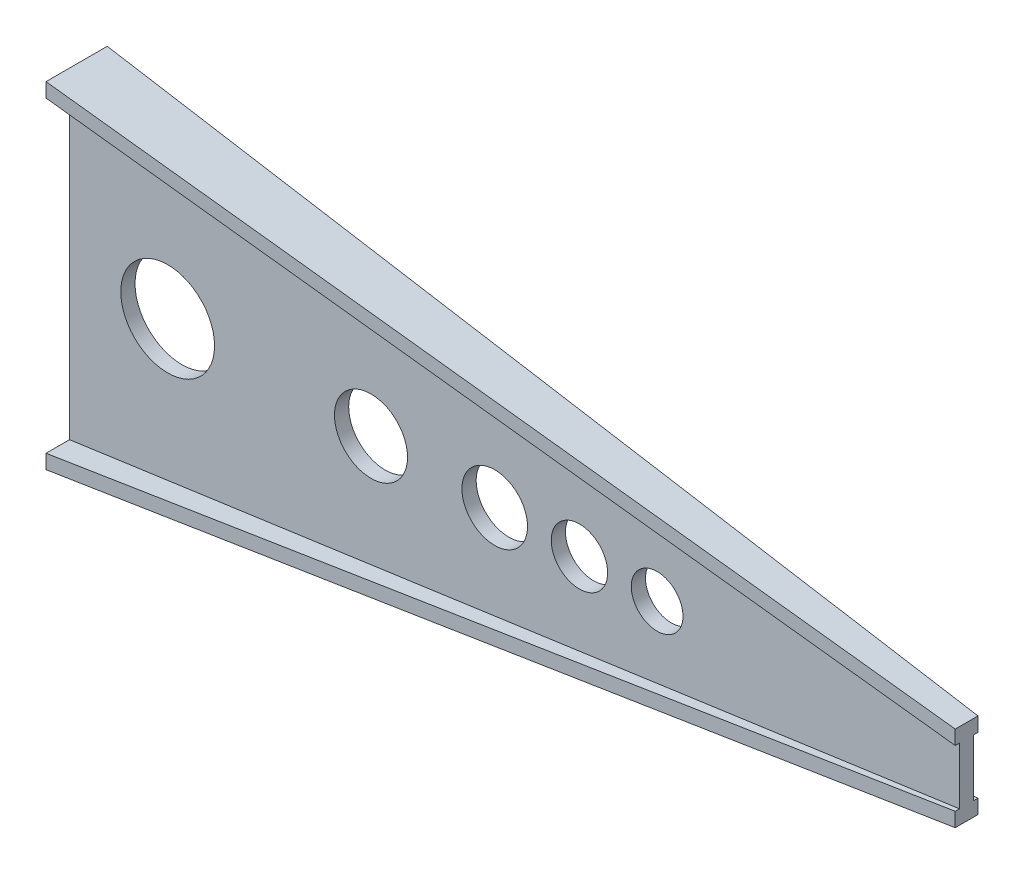
ISO-10303-21;
HEADER;
FILE_DESCRIPTION(('STEP AP214'),'2;1');
FILE_NAME('part.step','',(''),(''),'','','');
FILE_SCHEMA(('AUTOMOTIVE_DESIGN { 1 0 10303 214 1 1 1 1 }'));
ENDSEC;
DATA;
#1=APPLICATION_CONTEXT('core data for automotive mechanical design processes');
#2=APPLICATION_PROTOCOL_DEFINITION('international standard','automotive_design',2000,#1);
#3=PRODUCT_CONTEXT('',#1,'mechanical');
#4=PRODUCT('Part','Part','',(#3));
#5=PRODUCT_RELATED_PRODUCT_CATEGORY('part','',(#4));
#6=PRODUCT_DEFINITION_FORMATION('','',#4);
#7=PRODUCT_DEFINITION_CONTEXT('part definition',#1,'design');
#8=PRODUCT_DEFINITION('design','',#6,#7);
#9=PRODUCT_DEFINITION_SHAPE('','',#8);
#10=(LENGTH_UNIT() NAMED_UNIT(*) SI_UNIT(.MILLI.,.METRE.));
#11=(NAMED_UNIT(*) PLANE_ANGLE_UNIT() SI_UNIT($,.RADIAN.));
#12=(NAMED_UNIT(*) SI_UNIT($,.STERADIAN.) SOLID_ANGLE_UNIT());
#13=UNCERTAINTY_MEASURE_WITH_UNIT(LENGTH_MEASURE(1.E-05),#10,'distance_accuracy_value','');
#14=(GEOMETRIC_REPRESENTATION_CONTEXT(3) GLOBAL_UNCERTAINTY_ASSIGNED_CONTEXT((#13)) GLOBAL_UNIT_ASSIGNED_CONTEXT((#10,
#11,#12)) REPRESENTATION_CONTEXT('',''));
#15=CARTESIAN_POINT('',(0.,0.,0.));
#16=DIRECTION('',(0.,0.,1.));
#17=DIRECTION('',(1.,0.,0.));
#18=AXIS2_PLACEMENT_3D('',#15,#16,#17);
#19=CARTESIAN_POINT('',(1250.,0.,0.));
#20=DIRECTION('',(-1.,0.,0.));
#21=DIRECTION('',(0.,0.,1.));
#22=AXIS2_PLACEMENT_3D('',#19,#20,#21);
#23=PLANE('',#22);
#24=DIRECTION('',(0.,-1.,0.));
#25=VECTOR('',#24,1.);
#26=CARTESIAN_POINT('',(1250.,60.,-5.99999999999967));
#27=LINE('',#26,#25);
#28=CARTESIAN_POINT('',(1250.,60.,-5.99999999999967));
#29=VERTEX_POINT('',#28);
#30=CARTESIAN_POINT('',(1250.,40.,-5.99999999999967));
#31=VERTEX_POINT('',#30);
#32=EDGE_CURVE('E382',#29,#31,#27,.T.);
#33=ORIENTED_EDGE('',*,*,#32,.F.);
#34=DIRECTION('',(0.,0.,-1.));
#35=VECTOR('',#34,1.);
#36=CARTESIAN_POINT('',(1250.,60.,-5.99999999999967));
#37=LINE('',#36,#35);
#38=CARTESIAN_POINT('',(1250.,60.,26.0000000000002));
#39=VERTEX_POINT('',#38);
#40=EDGE_CURVE('E12',#39,#29,#37,.T.);
#41=ORIENTED_EDGE('',*,*,#40,.F.);
#42=DIRECTION('',(0.,1.,0.));
#43=VECTOR('',#42,1.);
#44=CARTESIAN_POINT('',(1250.,60.,26.0000000000002));
#45=LINE('',#44,#43);
#46=CARTESIAN_POINT('',(1250.,40.,26.0000000000002));
#47=VERTEX_POINT('',#46);
#48=EDGE_CURVE('E72',#47,#39,#45,.T.);
#49=ORIENTED_EDGE('',*,*,#48,.F.);
#50=DIRECTION('',(0.,0.,1.));
#51=VECTOR('',#50,1.);
#52=CARTESIAN_POINT('',(1250.,40.,20.0000000000002));
#53=LINE('',#52,#51);
#54=CARTESIAN_POINT('',(1250.,40.,20.0000000000002));
#55=VERTEX_POINT('',#54);
#56=EDGE_CURVE('E660',#55,#47,#53,.T.);
#57=ORIENTED_EDGE('',*,*,#56,.F.);
#58=DIRECTION('',(0.,1.,0.));
#59=VECTOR('',#58,1.);
#60=CARTESIAN_POINT('',(1250.,40.,20.0000000000002));
#61=LINE('',#60,#59);
#62=CARTESIAN_POINT('',(1250.,-40.,20.0000000000002));
#63=VERTEX_POINT('',#62);
#64=EDGE_CURVE('E419',#63,#55,#61,.T.);
#65=ORIENTED_EDGE('',*,*,#64,.F.);
#66=DIRECTION('',(0.,0.,-1.));
#67=VECTOR('',#66,1.);
#68=CARTESIAN_POINT('',(1250.,-40.,20.0000000000002));
#69=LINE('',#68,#67);
#70=CARTESIAN_POINT('',(1250.,-40.,26.0000000000002));
#71=VERTEX_POINT('',#70);
#72=EDGE_CURVE('E433',#71,#63,#69,.T.);
#73=ORIENTED_EDGE('',*,*,#72,.F.);
#74=DIRECTION('',(0.,1.,0.));
#75=VECTOR('',#74,1.);
#76=CARTESIAN_POINT('',(1250.,-40.,26.0000000000002));
#77=LINE('',#76,#75);
#78=CARTESIAN_POINT('',(1250.,-60.,26.0000000000002));
#79=VERTEX_POINT('',#78);
#80=EDGE_CURVE('E447',#79,#71,#77,.T.);
#81=ORIENTED_EDGE('',*,*,#80,.F.);
#82=DIRECTION('',(0.,0.,1.));
#83=VECTOR('',#82,1.);
#84=CARTESIAN_POINT('',(1250.,-60.,-5.99999999999967));
#85=LINE('',#84,#83);
#86=CARTESIAN_POINT('',(1250.,-60.,-5.99999999999967));
#87=VERTEX_POINT('',#86);
#88=EDGE_CURVE('E631',#87,#79,#85,.T.);
#89=ORIENTED_EDGE('',*,*,#88,.F.);
#90=DIRECTION('',(0.,-1.,0.));
#91=VECTOR('',#90,1.);
#92=CARTESIAN_POINT('',(1250.,-40.,-5.99999999999967));
#93=LINE('',#92,#91);
#94=CARTESIAN_POINT('',(1250.,-40.,-5.99999999999967));
#95=VERTEX_POINT('',#94);
#96=EDGE_CURVE('E623',#95,#87,#93,.T.);
#97=ORIENTED_EDGE('',*,*,#96,.F.);
#98=DIRECTION('',(0.,0.,-1.));
#99=VECTOR('',#98,1.);
#100=CARTESIAN_POINT('',(1250.,-40.,-5.99999999999967));
#101=LINE('',#100,#99);
#102=CARTESIAN_POINT('',(1250.,-40.,2.22044604925031E-13));
#103=VERTEX_POINT('',#102);
#104=EDGE_CURVE('E535',#103,#95,#101,.T.);
#105=ORIENTED_EDGE('',*,*,#104,.F.);
#106=DIRECTION('',(0.,-1.,0.));
#107=VECTOR('',#106,1.);
#108=CARTESIAN_POINT('',(1250.,40.,2.22044604925031E-13));
#109=LINE('',#108,#107);
#110=CARTESIAN_POINT('',(1250.,40.,2.22044604925031E-13));
#111=VERTEX_POINT('',#110);
#112=EDGE_CURVE('E86',#111,#103,#109,.T.);
#113=ORIENTED_EDGE('',*,*,#112,.F.);
#114=DIRECTION('',(0.,0.,1.));
#115=VECTOR('',#114,1.);
#116=CARTESIAN_POINT('',(1250.,40.,-5.99999999999967));
#117=LINE('',#116,#115);
#118=EDGE_CURVE('E80',#31,#111,#117,.T.);
#119=ORIENTED_EDGE('',*,*,#118,.F.);
#120=EDGE_LOOP('',(#33,#41,#49,#57,#65,#73,#81,#89,#97,#105,#113,#119));
#121=FACE_BOUND('',#120,.T.);
#122=ADVANCED_FACE('F63',(#121),#23,.F.);
#123=CARTESIAN_POINT('',(0.,0.,0.));
#124=DIRECTION('',(1.,0.,0.));
#125=DIRECTION('',(0.,0.,-1.));
#126=AXIS2_PLACEMENT_3D('',#123,#124,#125);
#127=PLANE('',#126);
#128=DIRECTION('',(0.,-1.,0.));
#129=VECTOR('',#128,1.);
#130=CARTESIAN_POINT('',(0.,236.,53.0000000000002));
#131=LINE('',#130,#129);
#132=CARTESIAN_POINT('',(0.,236.,53.0000000000002));
#133=VERTEX_POINT('',#132);
#134=CARTESIAN_POINT('',(0.,216.,53.0000000000002));
#135=VERTEX_POINT('',#134);
#136=EDGE_CURVE('E161',#133,#135,#131,.T.);
#137=ORIENTED_EDGE('',*,*,#136,.F.);
#138=DIRECTION('',(0.,0.,1.));
#139=VECTOR('',#138,1.);
#140=CARTESIAN_POINT('',(0.,236.,53.0000000000002));
#141=LINE('',#140,#139);
#142=CARTESIAN_POINT('',(0.,236.,-32.9999999999998));
#143=VERTEX_POINT('',#142);
#144=EDGE_CURVE('E170',#143,#133,#141,.T.);
#145=ORIENTED_EDGE('',*,*,#144,.F.);
#146=DIRECTION('',(0.,1.,0.));
#147=VECTOR('',#146,1.);
#148=CARTESIAN_POINT('',(0.,236.,-32.9999999999998));
#149=LINE('',#148,#147);
#150=CARTESIAN_POINT('',(0.,216.,-32.9999999999998));
#151=VERTEX_POINT('',#150);
#152=EDGE_CURVE('E177',#151,#143,#149,.T.);
#153=ORIENTED_EDGE('',*,*,#152,.F.);
#154=DIRECTION('',(0.,0.,-1.));
#155=VECTOR('',#154,1.);
#156=CARTESIAN_POINT('',(0.,216.,2.03398214690338E-13));
#157=LINE('',#156,#155);
#158=CARTESIAN_POINT('',(0.,216.,2.03398214690338E-13));
#159=VERTEX_POINT('',#158);
#160=EDGE_CURVE('E305',#159,#151,#157,.T.);
#161=ORIENTED_EDGE('',*,*,#160,.F.);
#162=DIRECTION('',(0.,1.,0.));
#163=VECTOR('',#162,1.);
#164=CARTESIAN_POINT('',(0.,216.,2.03398214690338E-13));
#165=LINE('',#164,#163);
#166=CARTESIAN_POINT('',(0.,-216.,2.03398214690338E-13));
#167=VERTEX_POINT('',#166);
#168=EDGE_CURVE('E301',#167,#159,#165,.T.);
#169=ORIENTED_EDGE('',*,*,#168,.F.);
#170=DIRECTION('',(0.,0.,1.));
#171=VECTOR('',#170,1.);
#172=CARTESIAN_POINT('',(0.,-216.,2.03398214690338E-13));
#173=LINE('',#172,#171);
#174=CARTESIAN_POINT('',(0.,-216.,-32.9999999999999));
#175=VERTEX_POINT('',#174);
#176=EDGE_CURVE('E297',#175,#167,#173,.T.);
#177=ORIENTED_EDGE('',*,*,#176,.F.);
#178=DIRECTION('',(0.,1.,0.));
#179=VECTOR('',#178,1.);
#180=CARTESIAN_POINT('',(0.,-216.,-32.9999999999999));
#181=LINE('',#180,#179);
#182=CARTESIAN_POINT('',(0.,-236.,-32.9999999999999));
#183=VERTEX_POINT('',#182);
#184=EDGE_CURVE('E293',#183,#175,#181,.T.);
#185=ORIENTED_EDGE('',*,*,#184,.F.);
#186=DIRECTION('',(0.,0.,-1.));
#187=VECTOR('',#186,1.);
#188=CARTESIAN_POINT('',(0.,-236.,53.0000000000001));
#189=LINE('',#188,#187);
#190=CARTESIAN_POINT('',(0.,-236.,53.0000000000001));
#191=VERTEX_POINT('',#190);
#192=EDGE_CURVE('E289',#191,#183,#189,.T.);
#193=ORIENTED_EDGE('',*,*,#192,.F.);
#194=DIRECTION('',(0.,-1.,0.));
#195=VECTOR('',#194,1.);
#196=CARTESIAN_POINT('',(0.,-216.,53.0000000000001));
#197=LINE('',#196,#195);
#198=CARTESIAN_POINT('',(0.,-216.,53.0000000000001));
#199=VERTEX_POINT('',#198);
#200=EDGE_CURVE('E285',#199,#191,#197,.T.);
#201=ORIENTED_EDGE('',*,*,#200,.F.);
#202=DIRECTION('',(0.,0.,1.));
#203=VECTOR('',#202,1.);
#204=CARTESIAN_POINT('',(0.,-216.,53.0000000000001));
#205=LINE('',#204,#203);
#206=CARTESIAN_POINT('',(0.,-216.,20.0000000000002));
#207=VERTEX_POINT('',#206);
#208=EDGE_CURVE('E280',#207,#199,#205,.T.);
#209=ORIENTED_EDGE('',*,*,#208,.F.);
#210=DIRECTION('',(0.,-1.,0.));
#211=VECTOR('',#210,1.);
#212=CARTESIAN_POINT('',(0.,216.,20.0000000000002));
#213=LINE('',#212,#211);
#214=CARTESIAN_POINT('',(0.,216.,20.0000000000002));
#215=VERTEX_POINT('',#214);
#216=EDGE_CURVE('E278',#215,#207,#213,.T.);
#217=ORIENTED_EDGE('',*,*,#216,.F.);
#218=DIRECTION('',(0.,0.,-1.));
#219=VECTOR('',#218,1.);
#220=CARTESIAN_POINT('',(0.,216.,53.0000000000002));
#221=LINE('',#220,#219);
#222=EDGE_CURVE('E184',#135,#215,#221,.T.);
#223=ORIENTED_EDGE('',*,*,#222,.F.);
#224=EDGE_LOOP('',(#137,#145,#153,#161,#169,#177,#185,#193,#201,#209,#217,#223));
#225=FACE_BOUND('',#224,.T.);
#226=ADVANCED_FACE('F182',(#225),#127,.F.);
#227=CARTESIAN_POINT('',(0.,0.,20.0000000000002));
#228=DIRECTION('',(0.,0.,1.));
#229=DIRECTION('',(1.,0.,0.));
#230=AXIS2_PLACEMENT_3D('',#227,#228,#229);
#231=PLANE('',#230);
#232=CARTESIAN_POINT('',(137.875176339264,0.,20.0000000000002));
#233=DIRECTION('',(0.,0.,1.));
#234=DIRECTION('',(1.,0.,0.));
#235=AXIS2_PLACEMENT_3D('',#232,#233,#234);
#236=CIRCLE('',#235,65.8387759066305);
#237=CARTESIAN_POINT('',(203.713952245895,0.,20.0000000000002));
#238=VERTEX_POINT('',#237);
#239=EDGE_CURVE('E774',#238,#238,#236,.T.);
#240=ORIENTED_EDGE('',*,*,#239,.F.);
#241=EDGE_LOOP('',(#240));
#242=FACE_BOUND('',#241,.T.);
#243=CARTESIAN_POINT('',(423.461863641876,0.,20.0000000000002));
#244=DIRECTION('',(0.,0.,1.));
#245=DIRECTION('',(1.,0.,0.));
#246=AXIS2_PLACEMENT_3D('',#243,#244,#245);
#247=CIRCLE('',#246,51.3401379448235);
#248=CARTESIAN_POINT('',(474.802001586699,0.,20.0000000000002));
#249=VERTEX_POINT('',#248);
#250=EDGE_CURVE('E777',#249,#249,#247,.T.);
#251=ORIENTED_EDGE('',*,*,#250,.F.);
#252=EDGE_LOOP('',(#251));
#253=FACE_BOUND('',#252,.T.);
#254=CARTESIAN_POINT('',(597.226106194989,0.,20.0000000000002));
#255=DIRECTION('',(0.,0.,1.));
#256=DIRECTION('',(1.,0.,0.));
#257=AXIS2_PLACEMENT_3D('',#254,#255,#256);
#258=CIRCLE('',#257,46.0827762782799);
#259=CARTESIAN_POINT('',(643.308882473269,0.,20.0000000000002));
#260=VERTEX_POINT('',#259);
#261=EDGE_CURVE('E783',#260,#260,#258,.T.);
#262=ORIENTED_EDGE('',*,*,#261,.F.);
#263=EDGE_LOOP('',(#262));
#264=FACE_BOUND('',#263,.T.);
#265=CARTESIAN_POINT('',(825.31333969711,0.,20.0000000000002));
#266=DIRECTION('',(0.,0.,1.));
#267=DIRECTION('',(1.,0.,0.));
#268=AXIS2_PLACEMENT_3D('',#265,#266,#267);
#269=CIRCLE('',#268,36.3132216652579);
#270=CARTESIAN_POINT('',(861.626561362368,0.,20.0000000000002));
#271=VERTEX_POINT('',#270);
#272=EDGE_CURVE('E788',#271,#271,#269,.T.);
#273=ORIENTED_EDGE('',*,*,#272,.F.);
#274=EDGE_LOOP('',(#273));
#275=FACE_BOUND('',#274,.T.);
#276=CARTESIAN_POINT('',(716.202882205903,0.,20.0000000000002));
#277=DIRECTION('',(0.,0.,1.));
#278=DIRECTION('',(1.,0.,0.));
#279=AXIS2_PLACEMENT_3D('',#276,#277,#278);
#280=CIRCLE('',#279,39.6209056920348);
#281=CARTESIAN_POINT('',(755.823787897938,0.,20.0000000000002));
#282=VERTEX_POINT('',#281);
#283=EDGE_CURVE('E790',#282,#282,#280,.T.);
#284=ORIENTED_EDGE('',*,*,#283,.F.);
#285=EDGE_LOOP('',(#284));
#286=FACE_BOUND('',#285,.T.);
#287=DIRECTION('',(0.990232667812309,0.139424759627973,0.));
#288=VECTOR('',#287,1.);
#289=CARTESIAN_POINT('',(0.,-216.,20.0000000000002));
#290=LINE('',#289,#288);
#291=EDGE_CURVE('E176',#207,#63,#290,.T.);
#292=ORIENTED_EDGE('',*,*,#291,.T.);
#293=ORIENTED_EDGE('',*,*,#64,.T.);
#294=DIRECTION('',(0.990232667812309,-0.139424759627973,0.));
#295=VECTOR('',#294,1.);
#296=CARTESIAN_POINT('',(0.,216.,20.0000000000002));
#297=LINE('',#296,#295);
#298=EDGE_CURVE('E392',#215,#55,#297,.T.);
#299=ORIENTED_EDGE('',*,*,#298,.F.);
#300=ORIENTED_EDGE('',*,*,#216,.T.);
#301=EDGE_LOOP('',(#292,#293,#299,#300));
#302=FACE_BOUND('',#301,.T.);
#303=ADVANCED_FACE('F206',(#242,#253,#264,#275,#286,#302),#231,.T.);
#304=CARTESIAN_POINT('',(29.8215975640675,211.801119062979,0.));
#305=DIRECTION('',(-0.139424759627973,-0.990232667812309,0.));
#306=DIRECTION('',(0.990232667812309,-0.139424759627973,0.));
#307=AXIS2_PLACEMENT_3D('',#304,#305,#306);
#308=PLANE('',#307);
#309=ORIENTED_EDGE('',*,*,#298,.T.);
#310=ORIENTED_EDGE('',*,*,#56,.T.);
#311=DIRECTION('',(0.990006234524492,-0.139392877821049,-0.021384134665729));
#312=VECTOR('',#311,1.);
#313=CARTESIAN_POINT('',(0.,216.,53.0000000000002));
#314=LINE('',#313,#312);
#315=EDGE_CURVE('E166',#135,#47,#314,.T.);
#316=ORIENTED_EDGE('',*,*,#315,.F.);
#317=ORIENTED_EDGE('',*,*,#222,.T.);
#318=EDGE_LOOP('',(#309,#310,#316,#317));
#319=FACE_BOUND('',#318,.T.);
#320=ADVANCED_FACE('F394',(#319),#308,.T.);
#321=CARTESIAN_POINT('',(29.8215975640675,-211.801119062979,0.));
#322=DIRECTION('',(-0.139424759627973,0.990232667812309,0.));
#323=DIRECTION('',(-0.990232667812309,-0.139424759627973,0.));
#324=AXIS2_PLACEMENT_3D('',#321,#322,#323);
#325=PLANE('',#324);
#326=DIRECTION('',(0.990006234524492,0.139392877821049,-0.0213841346657289));
#327=VECTOR('',#326,1.);
#328=CARTESIAN_POINT('',(0.,-216.,53.0000000000001));
#329=LINE('',#328,#327);
#330=EDGE_CURVE('E480',#199,#71,#329,.T.);
#331=ORIENTED_EDGE('',*,*,#330,.T.);
#332=ORIENTED_EDGE('',*,*,#72,.T.);
#333=ORIENTED_EDGE('',*,*,#291,.F.);
#334=ORIENTED_EDGE('',*,*,#208,.T.);
#335=EDGE_LOOP('',(#331,#332,#333,#334));
#336=FACE_BOUND('',#335,.T.);
#337=ADVANCED_FACE('F403',(#336),#325,.T.);
#338=CARTESIAN_POINT('',(1.14426613119382,0.,52.9752838515663));
#339=DIRECTION('',(0.0215949629145083,0.,0.999766801597613));
#340=DIRECTION('',(0.999766801597613,0.,-0.0215949629145083));
#341=AXIS2_PLACEMENT_3D('',#338,#339,#340);
#342=PLANE('',#341);
#343=DIRECTION('',(0.990006234524492,0.139392877821049,-0.0213841346657289));
#344=VECTOR('',#343,1.);
#345=CARTESIAN_POINT('',(0.,-236.,53.0000000000001));
#346=LINE('',#345,#344);
#347=EDGE_CURVE('E472',#191,#79,#346,.T.);
#348=ORIENTED_EDGE('',*,*,#347,.T.);
#349=ORIENTED_EDGE('',*,*,#80,.T.);
#350=ORIENTED_EDGE('',*,*,#330,.F.);
#351=ORIENTED_EDGE('',*,*,#200,.T.);
#352=EDGE_LOOP('',(#348,#349,#350,#351));
#353=FACE_BOUND('',#352,.T.);
#354=ADVANCED_FACE('F453',(#353),#342,.T.);
#355=CARTESIAN_POINT('',(32.5828565977774,-231.412333791033,0.));
#356=DIRECTION('',(0.139424759627973,-0.990232667812309,0.));
#357=DIRECTION('',(0.990232667812309,0.139424759627973,0.));
#358=AXIS2_PLACEMENT_3D('',#355,#356,#357);
#359=PLANE('',#358);
#360=DIRECTION('',(0.990006234524492,0.139392877821049,0.0213841346657292));
#361=VECTOR('',#360,1.);
#362=CARTESIAN_POINT('',(0.,-236.,-32.9999999999999));
#363=LINE('',#362,#361);
#364=EDGE_CURVE('E479',#183,#87,#363,.T.);
#365=ORIENTED_EDGE('',*,*,#364,.T.);
#366=ORIENTED_EDGE('',*,*,#88,.T.);
#367=ORIENTED_EDGE('',*,*,#347,.F.);
#368=ORIENTED_EDGE('',*,*,#192,.T.);
#369=EDGE_LOOP('',(#365,#366,#367,#368));
#370=FACE_BOUND('',#369,.T.);
#371=ADVANCED_FACE('F462',(#370),#359,.T.);
#372=CARTESIAN_POINT('',(0.712467591120692,0.,-32.9846107000317));
#373=DIRECTION('',(0.0215949629145086,0.,-0.999766801597613));
#374=DIRECTION('',(-0.999766801597613,0.,-0.0215949629145087));
#375=AXIS2_PLACEMENT_3D('',#372,#373,#374);
#376=PLANE('',#375);
#377=DIRECTION('',(0.990006234524492,0.139392877821049,0.0213841346657292));
#378=VECTOR('',#377,1.);
#379=CARTESIAN_POINT('',(0.,-216.,-32.9999999999999));
#380=LINE('',#379,#378);
#381=EDGE_CURVE('E497',#175,#95,#380,.T.);
#382=ORIENTED_EDGE('',*,*,#381,.T.);
#383=ORIENTED_EDGE('',*,*,#96,.T.);
#384=ORIENTED_EDGE('',*,*,#364,.F.);
#385=ORIENTED_EDGE('',*,*,#184,.T.);
#386=EDGE_LOOP('',(#382,#383,#384,#385));
#387=FACE_BOUND('',#386,.T.);
#388=ADVANCED_FACE('F508',(#387),#376,.T.);
#389=CARTESIAN_POINT('',(29.8215975640675,-211.801119062979,0.));
#390=DIRECTION('',(-0.139424759627973,0.990232667812309,0.));
#391=DIRECTION('',(-0.990232667812309,-0.139424759627973,0.));
#392=AXIS2_PLACEMENT_3D('',#389,#390,#391);
#393=PLANE('',#392);
#394=DIRECTION('',(0.990232667812309,0.139424759627973,0.));
#395=VECTOR('',#394,1.);
#396=CARTESIAN_POINT('',(0.,-216.,2.03398214690338E-13));
#397=LINE('',#396,#395);
#398=EDGE_CURVE('E575',#167,#103,#397,.T.);
#399=ORIENTED_EDGE('',*,*,#398,.T.);
#400=ORIENTED_EDGE('',*,*,#104,.T.);
#401=ORIENTED_EDGE('',*,*,#381,.F.);
#402=ORIENTED_EDGE('',*,*,#176,.T.);
#403=EDGE_LOOP('',(#399,#400,#401,#402));
#404=FACE_BOUND('',#403,.T.);
#405=ADVANCED_FACE('F517',(#404),#393,.T.);
#406=CARTESIAN_POINT('',(0.,0.,2.03398214690338E-13));
#407=DIRECTION('',(0.,0.,-1.));
#408=DIRECTION('',(-1.,0.,0.));
#409=AXIS2_PLACEMENT_3D('',#406,#407,#408);
#410=PLANE('',#409);
#411=CARTESIAN_POINT('',(137.875176339264,0.,2.0122792321331E-13));
#412=DIRECTION('',(0.,0.,-1.));
#413=DIRECTION('',(-1.,0.,0.));
#414=AXIS2_PLACEMENT_3D('',#411,#412,#413);
#415=CIRCLE('',#414,65.8387759066305);
#416=CARTESIAN_POINT('',(72.0364004326338,0.,2.00245798806806E-13));
#417=VERTEX_POINT('',#416);
#418=EDGE_CURVE('E67',#417,#417,#415,.T.);
#419=ORIENTED_EDGE('',*,*,#418,.F.);
#420=EDGE_LOOP('',(#419));
#421=FACE_BOUND('',#420,.T.);
#422=CARTESIAN_POINT('',(423.461863641876,0.,2.08166817117217E-13));
#423=DIRECTION('',(0.,0.,-1.));
#424=DIRECTION('',(-1.,0.,0.));
#425=AXIS2_PLACEMENT_3D('',#422,#423,#424);
#426=CIRCLE('',#425,51.3401379448235);
#427=CARTESIAN_POINT('',(372.121725697052,0.,2.07400970519759E-13));
#428=VERTEX_POINT('',#427);
#429=EDGE_CURVE('E909',#428,#428,#426,.T.);
#430=ORIENTED_EDGE('',*,*,#429,.F.);
#431=EDGE_LOOP('',(#430));
#432=FACE_BOUND('',#431,.T.);
#433=CARTESIAN_POINT('',(597.226106194989,0.,2.08166817117217E-13));
#434=DIRECTION('',(0.,0.,-1.));
#435=DIRECTION('',(-1.,0.,0.));
#436=AXIS2_PLACEMENT_3D('',#433,#434,#435);
#437=CIRCLE('',#436,46.0827762782799);
#438=CARTESIAN_POINT('',(551.143329916709,0.,2.07479395173551E-13));
#439=VERTEX_POINT('',#438);
#440=EDGE_CURVE('E903',#439,#439,#437,.T.);
#441=ORIENTED_EDGE('',*,*,#440,.F.);
#442=EDGE_LOOP('',(#441));
#443=FACE_BOUND('',#442,.T.);
#444=CARTESIAN_POINT('',(825.31333969711,0.,2.15105711021124E-13));
#445=DIRECTION('',(0.,0.,-1.));
#446=DIRECTION('',(-1.,0.,0.));
#447=AXIS2_PLACEMENT_3D('',#444,#445,#446);
#448=CIRCLE('',#447,36.3132216652579);
#449=CARTESIAN_POINT('',(789.000118031852,0.,2.14564022619645E-13));
#450=VERTEX_POINT('',#449);
#451=EDGE_CURVE('E780',#450,#450,#448,.T.);
#452=ORIENTED_EDGE('',*,*,#451,.F.);
#453=EDGE_LOOP('',(#452));
#454=FACE_BOUND('',#453,.T.);
#455=CARTESIAN_POINT('',(716.202882205903,0.,2.15105711021124E-13));
#456=DIRECTION('',(0.,0.,-1.));
#457=DIRECTION('',(-1.,0.,0.));
#458=AXIS2_PLACEMENT_3D('',#455,#456,#457);
#459=CIRCLE('',#458,39.6209056920348);
#460=CARTESIAN_POINT('',(676.581976513868,0.,2.14514681525936E-13));
#461=VERTEX_POINT('',#460);
#462=EDGE_CURVE('E776',#461,#461,#459,.T.);
#463=ORIENTED_EDGE('',*,*,#462,.F.);
#464=EDGE_LOOP('',(#463));
#465=FACE_BOUND('',#464,.T.);
#466=DIRECTION('',(0.990232667812309,-0.139424759627973,0.));
#467=VECTOR('',#466,1.);
#468=CARTESIAN_POINT('',(0.,216.,2.03398214690338E-13));
#469=LINE('',#468,#467);
#470=EDGE_CURVE('E567',#159,#111,#469,.T.);
#471=ORIENTED_EDGE('',*,*,#470,.T.);
#472=ORIENTED_EDGE('',*,*,#112,.T.);
#473=ORIENTED_EDGE('',*,*,#398,.F.);
#474=ORIENTED_EDGE('',*,*,#168,.T.);
#475=EDGE_LOOP('',(#471,#472,#473,#474));
#476=FACE_BOUND('',#475,.T.);
#477=ADVANCED_FACE('F551',(#421,#432,#443,#454,#465,#476),#410,.T.);
#478=CARTESIAN_POINT('',(29.8215975640675,211.801119062979,0.));
#479=DIRECTION('',(-0.139424759627973,-0.990232667812309,0.));
#480=DIRECTION('',(0.990232667812309,-0.139424759627973,0.));
#481=AXIS2_PLACEMENT_3D('',#478,#479,#480);
#482=PLANE('',#481);
#483=DIRECTION('',(0.990006234524492,-0.139392877821049,0.0213841346657291));
#484=VECTOR('',#483,1.);
#485=CARTESIAN_POINT('',(0.,216.,-32.9999999999998));
#486=LINE('',#485,#484);
#487=EDGE_CURVE('E574',#151,#31,#486,.T.);
#488=ORIENTED_EDGE('',*,*,#487,.T.);
#489=ORIENTED_EDGE('',*,*,#118,.T.);
#490=ORIENTED_EDGE('',*,*,#470,.F.);
#491=ORIENTED_EDGE('',*,*,#160,.T.);
#492=EDGE_LOOP('',(#488,#489,#490,#491));
#493=FACE_BOUND('',#492,.T.);
#494=ADVANCED_FACE('F332',(#493),#482,.T.);
#495=CARTESIAN_POINT('',(0.712467591120685,0.,-32.9846107000316));
#496=DIRECTION('',(0.0215949629145085,0.,-0.999766801597613));
#497=DIRECTION('',(-0.999766801597613,0.,-0.0215949629145085));
#498=AXIS2_PLACEMENT_3D('',#495,#496,#497);
#499=PLANE('',#498);
#500=DIRECTION('',(0.990006234524492,-0.139392877821049,0.0213841346657291));
#501=VECTOR('',#500,1.);
#502=CARTESIAN_POINT('',(0.,236.,-32.9999999999998));
#503=LINE('',#502,#501);
#504=EDGE_CURVE('E167',#143,#29,#503,.T.);
#505=ORIENTED_EDGE('',*,*,#504,.T.);
#506=ORIENTED_EDGE('',*,*,#32,.T.);
#507=ORIENTED_EDGE('',*,*,#487,.F.);
#508=ORIENTED_EDGE('',*,*,#152,.T.);
#509=EDGE_LOOP('',(#505,#506,#507,#508));
#510=FACE_BOUND('',#509,.T.);
#511=ADVANCED_FACE('F322',(#510),#499,.T.);
#512=CARTESIAN_POINT('',(32.5828565977774,231.412333791033,0.));
#513=DIRECTION('',(0.139424759627973,0.990232667812309,0.));
#514=DIRECTION('',(-0.990232667812309,0.139424759627973,0.));
#515=AXIS2_PLACEMENT_3D('',#512,#513,#514);
#516=PLANE('',#515);
#517=DIRECTION('',(0.990006234524492,-0.139392877821049,-0.021384134665729));
#518=VECTOR('',#517,1.);
#519=CARTESIAN_POINT('',(0.,236.,53.0000000000002));
#520=LINE('',#519,#518);
#521=EDGE_CURVE('E156',#133,#39,#520,.T.);
#522=ORIENTED_EDGE('',*,*,#521,.T.);
#523=ORIENTED_EDGE('',*,*,#40,.T.);
#524=ORIENTED_EDGE('',*,*,#504,.F.);
#525=ORIENTED_EDGE('',*,*,#144,.T.);
#526=EDGE_LOOP('',(#522,#523,#524,#525));
#527=FACE_BOUND('',#526,.T.);
#528=ADVANCED_FACE('F172',(#527),#516,.T.);
#529=CARTESIAN_POINT('',(1.14426613119383,0.,52.9752838515664));
#530=DIRECTION('',(0.0215949629145084,0.,0.999766801597613));
#531=DIRECTION('',(0.999766801597613,0.,-0.0215949629145084));
#532=AXIS2_PLACEMENT_3D('',#529,#530,#531);
#533=PLANE('',#532);
#534=ORIENTED_EDGE('',*,*,#315,.T.);
#535=ORIENTED_EDGE('',*,*,#48,.T.);
#536=ORIENTED_EDGE('',*,*,#521,.F.);
#537=ORIENTED_EDGE('',*,*,#136,.T.);
#538=EDGE_LOOP('',(#534,#535,#536,#537));
#539=FACE_BOUND('',#538,.T.);
#540=ADVANCED_FACE('F159',(#539),#533,.T.);
#541=CARTESIAN_POINT('',(716.202882205903,0.,-33.0000999999999));
#542=DIRECTION('',(0.,0.,1.));
#543=DIRECTION('',(1.,0.,0.));
#544=AXIS2_PLACEMENT_3D('',#541,#542,#543);
#545=CYLINDRICAL_SURFACE('',#544,39.6209056920348);
#546=ORIENTED_EDGE('',*,*,#462,.T.);
#547=EDGE_LOOP('',(#546));
#548=FACE_BOUND('',#547,.T.);
#549=ORIENTED_EDGE('',*,*,#283,.T.);
#550=EDGE_LOOP('',(#549));
#551=FACE_BOUND('',#550,.T.);
#552=ADVANCED_FACE('F207',(#548,#551),#545,.F.);
#553=CARTESIAN_POINT('',(825.31333969711,0.,-33.0000999999999));
#554=DIRECTION('',(0.,0.,1.));
#555=DIRECTION('',(1.,0.,0.));
#556=AXIS2_PLACEMENT_3D('',#553,#554,#555);
#557=CYLINDRICAL_SURFACE('',#556,36.3132216652579);
#558=ORIENTED_EDGE('',*,*,#451,.T.);
#559=EDGE_LOOP('',(#558));
#560=FACE_BOUND('',#559,.T.);
#561=ORIENTED_EDGE('',*,*,#272,.T.);
#562=EDGE_LOOP('',(#561));
#563=FACE_BOUND('',#562,.T.);
#564=ADVANCED_FACE('F737',(#560,#563),#557,.F.);
#565=CARTESIAN_POINT('',(597.226106194989,0.,-33.0000999999999));
#566=DIRECTION('',(0.,0.,1.));
#567=DIRECTION('',(1.,0.,0.));
#568=AXIS2_PLACEMENT_3D('',#565,#566,#567);
#569=CYLINDRICAL_SURFACE('',#568,46.0827762782799);
#570=ORIENTED_EDGE('',*,*,#440,.T.);
#571=EDGE_LOOP('',(#570));
#572=FACE_BOUND('',#571,.T.);
#573=ORIENTED_EDGE('',*,*,#261,.T.);
#574=EDGE_LOOP('',(#573));
#575=FACE_BOUND('',#574,.T.);
#576=ADVANCED_FACE('F724',(#572,#575),#569,.F.);
#577=CARTESIAN_POINT('',(423.461863641876,0.,-33.0000999999999));
#578=DIRECTION('',(0.,0.,1.));
#579=DIRECTION('',(1.,0.,0.));
#580=AXIS2_PLACEMENT_3D('',#577,#578,#579);
#581=CYLINDRICAL_SURFACE('',#580,51.3401379448235);
#582=ORIENTED_EDGE('',*,*,#429,.T.);
#583=EDGE_LOOP('',(#582));
#584=FACE_BOUND('',#583,.T.);
#585=ORIENTED_EDGE('',*,*,#250,.T.);
#586=EDGE_LOOP('',(#585));
#587=FACE_BOUND('',#586,.T.);
#588=ADVANCED_FACE('F719',(#584,#587),#581,.F.);
#589=CARTESIAN_POINT('',(137.875176339264,0.,-33.0000999999999));
#590=DIRECTION('',(0.,0.,1.));
#591=DIRECTION('',(1.,0.,0.));
#592=AXIS2_PLACEMENT_3D('',#589,#590,#591);
#593=CYLINDRICAL_SURFACE('',#592,65.8387759066305);
#594=ORIENTED_EDGE('',*,*,#418,.T.);
#595=EDGE_LOOP('',(#594));
#596=FACE_BOUND('',#595,.T.);
#597=ORIENTED_EDGE('',*,*,#239,.T.);
#598=EDGE_LOOP('',(#597));
#599=FACE_BOUND('',#598,.T.);
#600=ADVANCED_FACE('F723',(#596,#599),#593,.F.);
#601=CLOSED_SHELL('',(#122,#226,#303,#320,#337,#354,#371,#388,#405,#477,#494,#511,#528,#540,
#552,#564,#576,#588,#600));
#602=MANIFOLD_SOLID_BREP('B2',#601);
#603=ADVANCED_BREP_SHAPE_REPRESENTATION('',(#18,#602),#14);
#604=SHAPE_DEFINITION_REPRESENTATION(#9,#603);
ENDSEC;
END-ISO-10303-21;
